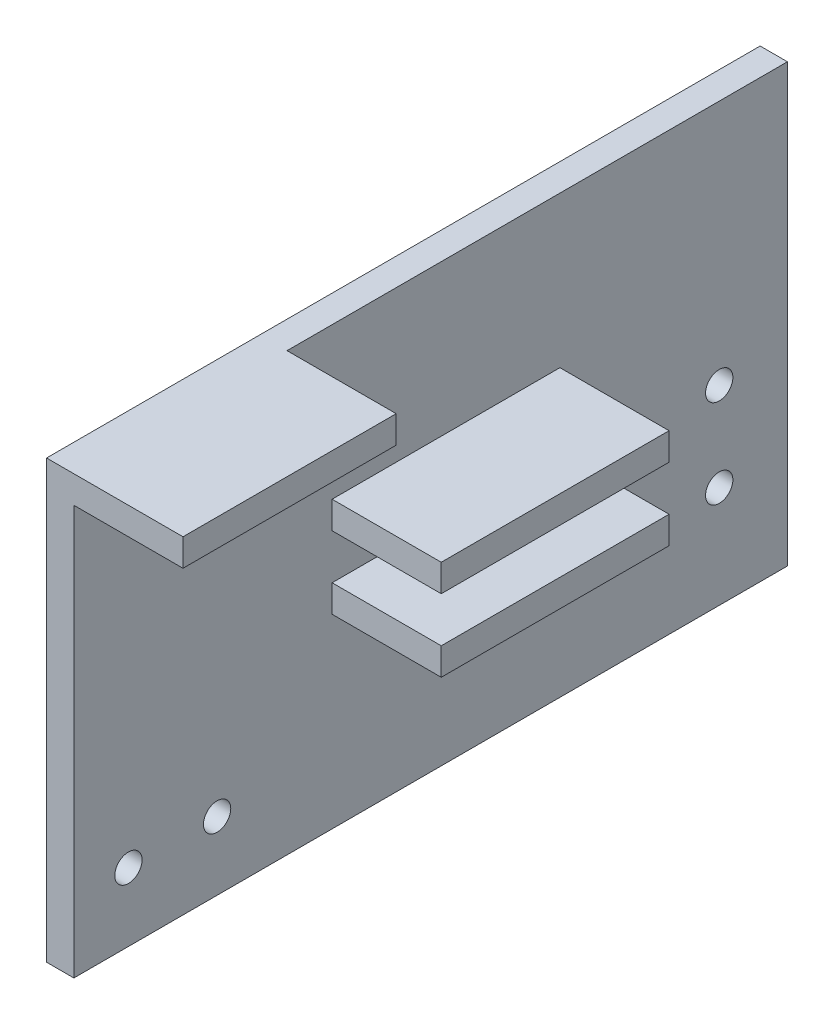
ISO-10303-21;
HEADER;
FILE_DESCRIPTION(('STEP AP214'),'2;1');
FILE_NAME('part.step','',(''),(''),'','','');
FILE_SCHEMA(('AUTOMOTIVE_DESIGN { 1 0 10303 214 1 1 1 1 }'));
ENDSEC;
DATA;
#1=APPLICATION_CONTEXT('core data for automotive mechanical design processes');
#2=APPLICATION_PROTOCOL_DEFINITION('international standard','automotive_design',2000,#1);
#3=PRODUCT_CONTEXT('',#1,'mechanical');
#4=PRODUCT('Part','Part','',(#3));
#5=PRODUCT_RELATED_PRODUCT_CATEGORY('part','',(#4));
#6=PRODUCT_DEFINITION_FORMATION('','',#4);
#7=PRODUCT_DEFINITION_CONTEXT('part definition',#1,'design');
#8=PRODUCT_DEFINITION('design','',#6,#7);
#9=PRODUCT_DEFINITION_SHAPE('','',#8);
#10=(LENGTH_UNIT() NAMED_UNIT(*) SI_UNIT(.MILLI.,.METRE.));
#11=(NAMED_UNIT(*) PLANE_ANGLE_UNIT() SI_UNIT($,.RADIAN.));
#12=(NAMED_UNIT(*) SI_UNIT($,.STERADIAN.) SOLID_ANGLE_UNIT());
#13=UNCERTAINTY_MEASURE_WITH_UNIT(LENGTH_MEASURE(1.E-05),#10,'distance_accuracy_value','');
#14=(GEOMETRIC_REPRESENTATION_CONTEXT(3) GLOBAL_UNCERTAINTY_ASSIGNED_CONTEXT((#13)) GLOBAL_UNIT_ASSIGNED_CONTEXT((#10,
#11,#12)) REPRESENTATION_CONTEXT('',''));
#15=CARTESIAN_POINT('',(0.,0.,0.));
#16=DIRECTION('',(0.,0.,1.));
#17=DIRECTION('',(1.,0.,0.));
#18=AXIS2_PLACEMENT_3D('',#15,#16,#17);
#19=CARTESIAN_POINT('',(2.,14.73202564,0.));
#20=DIRECTION('',(0.,-1.,0.));
#21=DIRECTION('',(0.,0.,-1.));
#22=AXIS2_PLACEMENT_3D('',#19,#20,#21);
#23=PLANE('',#22);
#24=DIRECTION('',(0.,0.,1.));
#25=VECTOR('',#24,1.);
#26=CARTESIAN_POINT('',(0.,14.73202564,0.));
#27=LINE('',#26,#25);
#28=CARTESIAN_POINT('',(0.,14.73202564,-52.3));
#29=VERTEX_POINT('',#28);
#30=CARTESIAN_POINT('',(0.,14.73202564,0.));
#31=VERTEX_POINT('',#30);
#32=EDGE_CURVE('E273',#29,#31,#27,.T.);
#33=ORIENTED_EDGE('',*,*,#32,.T.);
#34=DIRECTION('',(-1.,0.,0.));
#35=VECTOR('',#34,1.);
#36=CARTESIAN_POINT('',(2.,14.73202564,0.));
#37=LINE('',#36,#35);
#38=CARTESIAN_POINT('',(10.,14.73202564,0.));
#39=VERTEX_POINT('',#38);
#40=EDGE_CURVE('E11',#39,#31,#37,.T.);
#41=ORIENTED_EDGE('',*,*,#40,.F.);
#42=DIRECTION('',(0.,0.,1.));
#43=VECTOR('',#42,1.);
#44=CARTESIAN_POINT('',(10.,14.73202564,0.));
#45=LINE('',#44,#43);
#46=CARTESIAN_POINT('',(10.,14.73202564,-15.625));
#47=VERTEX_POINT('',#46);
#48=EDGE_CURVE('E218',#47,#39,#45,.T.);
#49=ORIENTED_EDGE('',*,*,#48,.F.);
#50=DIRECTION('',(-1.,0.,0.));
#51=VECTOR('',#50,1.);
#52=CARTESIAN_POINT('',(10.,14.73202564,-15.625));
#53=LINE('',#52,#51);
#54=CARTESIAN_POINT('',(2.,14.73202564,-15.625));
#55=VERTEX_POINT('',#54);
#56=EDGE_CURVE('E230',#47,#55,#53,.T.);
#57=ORIENTED_EDGE('',*,*,#56,.T.);
#58=DIRECTION('',(0.,0.,1.));
#59=VECTOR('',#58,1.);
#60=CARTESIAN_POINT('',(2.,14.73202564,0.));
#61=LINE('',#60,#59);
#62=CARTESIAN_POINT('',(2.,14.73202564,-52.3));
#63=VERTEX_POINT('',#62);
#64=EDGE_CURVE('E252',#63,#55,#61,.T.);
#65=ORIENTED_EDGE('',*,*,#64,.F.);
#66=DIRECTION('',(-1.,0.,0.));
#67=VECTOR('',#66,1.);
#68=CARTESIAN_POINT('',(2.,14.73202564,-52.3));
#69=LINE('',#68,#67);
#70=EDGE_CURVE('E261',#63,#29,#69,.T.);
#71=ORIENTED_EDGE('',*,*,#70,.T.);
#72=EDGE_LOOP('',(#33,#41,#49,#57,#65,#71));
#73=FACE_BOUND('',#72,.T.);
#74=ADVANCED_FACE('F36',(#73),#23,.F.);
#75=CARTESIAN_POINT('',(2.,0.,0.));
#76=DIRECTION('',(0.,0.,-1.));
#77=DIRECTION('',(0.,1.,0.));
#78=AXIS2_PLACEMENT_3D('',#75,#76,#77);
#79=PLANE('',#78);
#80=DIRECTION('',(0.,-1.,0.));
#81=VECTOR('',#80,1.);
#82=CARTESIAN_POINT('',(0.,0.,0.));
#83=LINE('',#82,#81);
#84=CARTESIAN_POINT('',(0.,-17.27497436,0.));
#85=VERTEX_POINT('',#84);
#86=EDGE_CURVE('E275',#31,#85,#83,.T.);
#87=ORIENTED_EDGE('',*,*,#86,.T.);
#88=DIRECTION('',(-1.,0.,0.));
#89=VECTOR('',#88,1.);
#90=CARTESIAN_POINT('',(2.,-17.27497436,0.));
#91=LINE('',#90,#89);
#92=CARTESIAN_POINT('',(2.,-17.27497436,0.));
#93=VERTEX_POINT('',#92);
#94=EDGE_CURVE('E44',#93,#85,#91,.T.);
#95=ORIENTED_EDGE('',*,*,#94,.F.);
#96=DIRECTION('',(0.,-1.,0.));
#97=VECTOR('',#96,1.);
#98=CARTESIAN_POINT('',(2.,0.,0.));
#99=LINE('',#98,#97);
#100=CARTESIAN_POINT('',(2.,12.73202564,0.));
#101=VERTEX_POINT('',#100);
#102=EDGE_CURVE('E255',#101,#93,#99,.T.);
#103=ORIENTED_EDGE('',*,*,#102,.F.);
#104=DIRECTION('',(-1.,0.,0.));
#105=VECTOR('',#104,1.);
#106=CARTESIAN_POINT('',(10.,12.73202564,0.));
#107=LINE('',#106,#105);
#108=CARTESIAN_POINT('',(10.,12.73202564,0.));
#109=VERTEX_POINT('',#108);
#110=EDGE_CURVE('E228',#109,#101,#107,.T.);
#111=ORIENTED_EDGE('',*,*,#110,.F.);
#112=DIRECTION('',(0.,-1.,0.));
#113=VECTOR('',#112,1.);
#114=CARTESIAN_POINT('',(10.,0.,0.));
#115=LINE('',#114,#113);
#116=EDGE_CURVE('E221',#39,#109,#115,.T.);
#117=ORIENTED_EDGE('',*,*,#116,.F.);
#118=ORIENTED_EDGE('',*,*,#40,.T.);
#119=EDGE_LOOP('',(#87,#95,#103,#111,#117,#118));
#120=FACE_BOUND('',#119,.T.);
#121=ADVANCED_FACE('F311',(#120),#79,.F.);
#122=CARTESIAN_POINT('',(2.,-17.27497436,0.));
#123=DIRECTION('',(0.,1.,0.));
#124=DIRECTION('',(0.,0.,1.));
#125=AXIS2_PLACEMENT_3D('',#122,#123,#124);
#126=PLANE('',#125);
#127=DIRECTION('',(0.,0.,-1.));
#128=VECTOR('',#127,1.);
#129=CARTESIAN_POINT('',(0.,-17.27497436,0.));
#130=LINE('',#129,#128);
#131=CARTESIAN_POINT('',(0.,-17.27497436,-52.3));
#132=VERTEX_POINT('',#131);
#133=EDGE_CURVE('E277',#85,#132,#130,.T.);
#134=ORIENTED_EDGE('',*,*,#133,.T.);
#135=DIRECTION('',(-1.,0.,0.));
#136=VECTOR('',#135,1.);
#137=CARTESIAN_POINT('',(2.,-17.27497436,-52.3));
#138=LINE('',#137,#136);
#139=CARTESIAN_POINT('',(2.,-17.27497436,-52.3));
#140=VERTEX_POINT('',#139);
#141=EDGE_CURVE('E282',#140,#132,#138,.T.);
#142=ORIENTED_EDGE('',*,*,#141,.F.);
#143=DIRECTION('',(0.,0.,-1.));
#144=VECTOR('',#143,1.);
#145=CARTESIAN_POINT('',(2.,-17.27497436,0.));
#146=LINE('',#145,#144);
#147=EDGE_CURVE('E257',#93,#140,#146,.T.);
#148=ORIENTED_EDGE('',*,*,#147,.F.);
#149=ORIENTED_EDGE('',*,*,#94,.T.);
#150=EDGE_LOOP('',(#134,#142,#148,#149));
#151=FACE_BOUND('',#150,.T.);
#152=ADVANCED_FACE('F289',(#151),#126,.F.);
#153=CARTESIAN_POINT('',(2.,-12.27497436,-4.00000000000001));
#154=DIRECTION('',(-1.,0.,0.));
#155=DIRECTION('',(0.,0.,1.));
#156=AXIS2_PLACEMENT_3D('',#153,#154,#155);
#157=CYLINDRICAL_SURFACE('',#156,1.);
#158=CARTESIAN_POINT('',(2.,-12.27497436,-4.00000000000001));
#159=DIRECTION('',(1.,0.,0.));
#160=DIRECTION('',(0.,0.,-1.));
#161=AXIS2_PLACEMENT_3D('',#158,#159,#160);
#162=CIRCLE('',#161,1.);
#163=CARTESIAN_POINT('',(2.,-12.27497436,-5.00000000000001));
#164=VERTEX_POINT('',#163);
#165=EDGE_CURVE('E249',#164,#164,#162,.T.);
#166=ORIENTED_EDGE('',*,*,#165,.T.);
#167=EDGE_LOOP('',(#166));
#168=FACE_BOUND('',#167,.T.);
#169=CARTESIAN_POINT('',(0.,-12.27497436,-4.00000000000001));
#170=DIRECTION('',(1.,0.,0.));
#171=DIRECTION('',(0.,0.,-1.));
#172=AXIS2_PLACEMENT_3D('',#169,#170,#171);
#173=CIRCLE('',#172,1.);
#174=CARTESIAN_POINT('',(0.,-12.27497436,-5.00000000000001));
#175=VERTEX_POINT('',#174);
#176=EDGE_CURVE('E270',#175,#175,#173,.T.);
#177=ORIENTED_EDGE('',*,*,#176,.F.);
#178=EDGE_LOOP('',(#177));
#179=FACE_BOUND('',#178,.T.);
#180=ADVANCED_FACE('F339',(#168,#179),#157,.F.);
#181=CARTESIAN_POINT('',(2.,-12.27497436,-10.5));
#182=DIRECTION('',(-1.,0.,0.));
#183=DIRECTION('',(0.,0.,1.));
#184=AXIS2_PLACEMENT_3D('',#181,#182,#183);
#185=CYLINDRICAL_SURFACE('',#184,1.);
#186=CARTESIAN_POINT('',(2.,-12.27497436,-10.5));
#187=DIRECTION('',(1.,0.,0.));
#188=DIRECTION('',(0.,0.,-1.));
#189=AXIS2_PLACEMENT_3D('',#186,#187,#188);
#190=CIRCLE('',#189,1.);
#191=CARTESIAN_POINT('',(2.,-12.27497436,-11.5));
#192=VERTEX_POINT('',#191);
#193=EDGE_CURVE('E246',#192,#192,#190,.T.);
#194=ORIENTED_EDGE('',*,*,#193,.T.);
#195=EDGE_LOOP('',(#194));
#196=FACE_BOUND('',#195,.T.);
#197=CARTESIAN_POINT('',(0.,-12.27497436,-10.5));
#198=DIRECTION('',(1.,0.,0.));
#199=DIRECTION('',(0.,0.,-1.));
#200=AXIS2_PLACEMENT_3D('',#197,#198,#199);
#201=CIRCLE('',#200,1.);
#202=CARTESIAN_POINT('',(0.,-12.27497436,-11.5));
#203=VERTEX_POINT('',#202);
#204=EDGE_CURVE('E267',#203,#203,#201,.T.);
#205=ORIENTED_EDGE('',*,*,#204,.F.);
#206=EDGE_LOOP('',(#205));
#207=FACE_BOUND('',#206,.T.);
#208=ADVANCED_FACE('F342',(#196,#207),#185,.F.);
#209=CARTESIAN_POINT('',(2.,-9.79999999999999,-47.3));
#210=DIRECTION('',(-1.,0.,0.));
#211=DIRECTION('',(0.,0.,1.));
#212=AXIS2_PLACEMENT_3D('',#209,#210,#211);
#213=CYLINDRICAL_SURFACE('',#212,0.999999999999998);
#214=CARTESIAN_POINT('',(2.,-9.79999999999999,-47.3));
#215=DIRECTION('',(1.,0.,0.));
#216=DIRECTION('',(0.,0.,-1.));
#217=AXIS2_PLACEMENT_3D('',#214,#215,#216);
#218=CIRCLE('',#217,0.999999999999998);
#219=CARTESIAN_POINT('',(2.,-9.79999999999999,-48.3));
#220=VERTEX_POINT('',#219);
#221=EDGE_CURVE('E242',#220,#220,#218,.T.);
#222=ORIENTED_EDGE('',*,*,#221,.T.);
#223=EDGE_LOOP('',(#222));
#224=FACE_BOUND('',#223,.T.);
#225=CARTESIAN_POINT('',(0.,-9.79999999999999,-47.3));
#226=DIRECTION('',(1.,0.,0.));
#227=DIRECTION('',(0.,0.,-1.));
#228=AXIS2_PLACEMENT_3D('',#225,#226,#227);
#229=CIRCLE('',#228,0.999999999999998);
#230=CARTESIAN_POINT('',(0.,-9.79999999999999,-48.3));
#231=VERTEX_POINT('',#230);
#232=EDGE_CURVE('E264',#231,#231,#229,.T.);
#233=ORIENTED_EDGE('',*,*,#232,.F.);
#234=EDGE_LOOP('',(#233));
#235=FACE_BOUND('',#234,.T.);
#236=ADVANCED_FACE('F345',(#224,#235),#213,.F.);
#237=CARTESIAN_POINT('',(2.,-3.3,-47.3));
#238=DIRECTION('',(-1.,0.,0.));
#239=DIRECTION('',(0.,0.,1.));
#240=AXIS2_PLACEMENT_3D('',#237,#238,#239);
#241=CYLINDRICAL_SURFACE('',#240,0.999999999999998);
#242=CARTESIAN_POINT('',(2.,-3.3,-47.3));
#243=DIRECTION('',(1.,0.,0.));
#244=DIRECTION('',(0.,0.,-1.));
#245=AXIS2_PLACEMENT_3D('',#242,#243,#244);
#246=CIRCLE('',#245,0.999999999999998);
#247=CARTESIAN_POINT('',(2.,-3.3,-48.3));
#248=VERTEX_POINT('',#247);
#249=EDGE_CURVE('E239',#248,#248,#246,.T.);
#250=ORIENTED_EDGE('',*,*,#249,.T.);
#251=EDGE_LOOP('',(#250));
#252=FACE_BOUND('',#251,.T.);
#253=CARTESIAN_POINT('',(0.,-3.3,-47.3));
#254=DIRECTION('',(1.,0.,0.));
#255=DIRECTION('',(0.,0.,-1.));
#256=AXIS2_PLACEMENT_3D('',#253,#254,#255);
#257=CIRCLE('',#256,0.999999999999998);
#258=CARTESIAN_POINT('',(0.,-3.3,-48.3));
#259=VERTEX_POINT('',#258);
#260=EDGE_CURVE('E238',#259,#259,#257,.T.);
#261=ORIENTED_EDGE('',*,*,#260,.F.);
#262=EDGE_LOOP('',(#261));
#263=FACE_BOUND('',#262,.T.);
#264=ADVANCED_FACE('F38',(#252,#263),#241,.F.);
#265=CARTESIAN_POINT('',(2.,0.,-52.3));
#266=DIRECTION('',(0.,0.,1.));
#267=DIRECTION('',(1.,0.,0.));
#268=AXIS2_PLACEMENT_3D('',#265,#266,#267);
#269=PLANE('',#268);
#270=DIRECTION('',(0.,1.,0.));
#271=VECTOR('',#270,1.);
#272=CARTESIAN_POINT('',(0.,0.,-52.3));
#273=LINE('',#272,#271);
#274=EDGE_CURVE('E243',#132,#29,#273,.T.);
#275=ORIENTED_EDGE('',*,*,#274,.T.);
#276=ORIENTED_EDGE('',*,*,#70,.F.);
#277=DIRECTION('',(0.,1.,0.));
#278=VECTOR('',#277,1.);
#279=CARTESIAN_POINT('',(2.,0.,-52.3));
#280=LINE('',#279,#278);
#281=EDGE_CURVE('E259',#140,#63,#280,.T.);
#282=ORIENTED_EDGE('',*,*,#281,.F.);
#283=ORIENTED_EDGE('',*,*,#141,.T.);
#284=EDGE_LOOP('',(#275,#276,#282,#283));
#285=FACE_BOUND('',#284,.T.);
#286=ADVANCED_FACE('F301',(#285),#269,.F.);
#287=CARTESIAN_POINT('',(2.,0.,0.));
#288=DIRECTION('',(1.,0.,0.));
#289=DIRECTION('',(0.,0.,-1.));
#290=AXIS2_PLACEMENT_3D('',#287,#288,#289);
#291=PLANE('',#290);
#292=DIRECTION('',(0.,1.,0.));
#293=VECTOR('',#292,1.);
#294=CARTESIAN_POINT('',(2.,0.,-35.625));
#295=LINE('',#294,#293);
#296=CARTESIAN_POINT('',(2.,-3.651,-35.625));
#297=VERTEX_POINT('',#296);
#298=CARTESIAN_POINT('',(2.,-1.651,-35.625));
#299=VERTEX_POINT('',#298);
#300=EDGE_CURVE('E151',#297,#299,#295,.T.);
#301=ORIENTED_EDGE('',*,*,#300,.F.);
#302=DIRECTION('',(0.,0.,1.));
#303=VECTOR('',#302,1.);
#304=CARTESIAN_POINT('',(2.,-3.651,0.));
#305=LINE('',#304,#303);
#306=CARTESIAN_POINT('',(2.,-3.651,-18.927));
#307=VERTEX_POINT('',#306);
#308=EDGE_CURVE('E155',#297,#307,#305,.T.);
#309=ORIENTED_EDGE('',*,*,#308,.T.);
#310=DIRECTION('',(0.,1.,0.));
#311=VECTOR('',#310,1.);
#312=CARTESIAN_POINT('',(2.,0.,-18.927));
#313=LINE('',#312,#311);
#314=CARTESIAN_POINT('',(2.,-1.651,-18.927));
#315=VERTEX_POINT('',#314);
#316=EDGE_CURVE('E179',#307,#315,#313,.T.);
#317=ORIENTED_EDGE('',*,*,#316,.T.);
#318=DIRECTION('',(0.,0.,1.));
#319=VECTOR('',#318,1.);
#320=CARTESIAN_POINT('',(2.,-1.651,0.));
#321=LINE('',#320,#319);
#322=EDGE_CURVE('E182',#299,#315,#321,.T.);
#323=ORIENTED_EDGE('',*,*,#322,.F.);
#324=EDGE_LOOP('',(#301,#309,#317,#323));
#325=FACE_BOUND('',#324,.T.);
#326=DIRECTION('',(0.,1.,0.));
#327=VECTOR('',#326,1.);
#328=CARTESIAN_POINT('',(2.,0.,-35.625));
#329=LINE('',#328,#327);
#330=CARTESIAN_POINT('',(2.,1.651,-35.625));
#331=VERTEX_POINT('',#330);
#332=CARTESIAN_POINT('',(2.,3.651,-35.625));
#333=VERTEX_POINT('',#332);
#334=EDGE_CURVE('E213',#331,#333,#329,.T.);
#335=ORIENTED_EDGE('',*,*,#334,.F.);
#336=DIRECTION('',(0.,0.,1.));
#337=VECTOR('',#336,1.);
#338=CARTESIAN_POINT('',(2.,1.651,0.));
#339=LINE('',#338,#337);
#340=CARTESIAN_POINT('',(2.,1.651,-18.927));
#341=VERTEX_POINT('',#340);
#342=EDGE_CURVE('E205',#331,#341,#339,.T.);
#343=ORIENTED_EDGE('',*,*,#342,.T.);
#344=DIRECTION('',(0.,1.,0.));
#345=VECTOR('',#344,1.);
#346=CARTESIAN_POINT('',(2.,0.,-18.927));
#347=LINE('',#346,#345);
#348=CARTESIAN_POINT('',(2.,3.651,-18.927));
#349=VERTEX_POINT('',#348);
#350=EDGE_CURVE('E208',#341,#349,#347,.T.);
#351=ORIENTED_EDGE('',*,*,#350,.T.);
#352=DIRECTION('',(0.,0.,1.));
#353=VECTOR('',#352,1.);
#354=CARTESIAN_POINT('',(2.,3.651,0.));
#355=LINE('',#354,#353);
#356=EDGE_CURVE('E211',#333,#349,#355,.T.);
#357=ORIENTED_EDGE('',*,*,#356,.F.);
#358=EDGE_LOOP('',(#335,#343,#351,#357));
#359=FACE_BOUND('',#358,.T.);
#360=DIRECTION('',(0.,1.,0.));
#361=VECTOR('',#360,1.);
#362=CARTESIAN_POINT('',(2.,0.,-15.625));
#363=LINE('',#362,#361);
#364=CARTESIAN_POINT('',(2.,12.73202564,-15.625));
#365=VERTEX_POINT('',#364);
#366=EDGE_CURVE('E236',#365,#55,#363,.T.);
#367=ORIENTED_EDGE('',*,*,#366,.F.);
#368=DIRECTION('',(0.,0.,1.));
#369=VECTOR('',#368,1.);
#370=CARTESIAN_POINT('',(2.,12.73202564,0.));
#371=LINE('',#370,#369);
#372=EDGE_CURVE('E233',#365,#101,#371,.T.);
#373=ORIENTED_EDGE('',*,*,#372,.T.);
#374=ORIENTED_EDGE('',*,*,#102,.T.);
#375=ORIENTED_EDGE('',*,*,#147,.T.);
#376=ORIENTED_EDGE('',*,*,#281,.T.);
#377=ORIENTED_EDGE('',*,*,#64,.T.);
#378=EDGE_LOOP('',(#367,#373,#374,#375,#376,#377));
#379=FACE_BOUND('',#378,.T.);
#380=ORIENTED_EDGE('',*,*,#249,.F.);
#381=EDGE_LOOP('',(#380));
#382=FACE_BOUND('',#381,.T.);
#383=ORIENTED_EDGE('',*,*,#221,.F.);
#384=EDGE_LOOP('',(#383));
#385=FACE_BOUND('',#384,.T.);
#386=ORIENTED_EDGE('',*,*,#193,.F.);
#387=EDGE_LOOP('',(#386));
#388=FACE_BOUND('',#387,.T.);
#389=ORIENTED_EDGE('',*,*,#165,.F.);
#390=EDGE_LOOP('',(#389));
#391=FACE_BOUND('',#390,.T.);
#392=ADVANCED_FACE('F308',(#325,#359,#379,#382,#385,#388,#391),#291,.T.);
#393=CARTESIAN_POINT('',(0.,0.,0.));
#394=DIRECTION('',(1.,0.,0.));
#395=DIRECTION('',(0.,0.,-1.));
#396=AXIS2_PLACEMENT_3D('',#393,#394,#395);
#397=PLANE('',#396);
#398=ORIENTED_EDGE('',*,*,#86,.F.);
#399=ORIENTED_EDGE('',*,*,#32,.F.);
#400=ORIENTED_EDGE('',*,*,#274,.F.);
#401=ORIENTED_EDGE('',*,*,#133,.F.);
#402=EDGE_LOOP('',(#398,#399,#400,#401));
#403=FACE_BOUND('',#402,.T.);
#404=ORIENTED_EDGE('',*,*,#260,.T.);
#405=EDGE_LOOP('',(#404));
#406=FACE_BOUND('',#405,.T.);
#407=ORIENTED_EDGE('',*,*,#232,.T.);
#408=EDGE_LOOP('',(#407));
#409=FACE_BOUND('',#408,.T.);
#410=ORIENTED_EDGE('',*,*,#204,.T.);
#411=EDGE_LOOP('',(#410));
#412=FACE_BOUND('',#411,.T.);
#413=ORIENTED_EDGE('',*,*,#176,.T.);
#414=EDGE_LOOP('',(#413));
#415=FACE_BOUND('',#414,.T.);
#416=ADVANCED_FACE('F296',(#403,#406,#409,#412,#415),#397,.F.);
#417=CARTESIAN_POINT('',(10.,0.,-15.625));
#418=DIRECTION('',(0.,0.,-1.));
#419=DIRECTION('',(0.,1.,0.));
#420=AXIS2_PLACEMENT_3D('',#417,#418,#419);
#421=PLANE('',#420);
#422=DIRECTION('',(-1.,0.,0.));
#423=VECTOR('',#422,1.);
#424=CARTESIAN_POINT('',(10.,12.73202564,-15.625));
#425=LINE('',#424,#423);
#426=CARTESIAN_POINT('',(10.,12.73202564,-15.625));
#427=VERTEX_POINT('',#426);
#428=EDGE_CURVE('E225',#427,#365,#425,.T.);
#429=ORIENTED_EDGE('',*,*,#428,.T.);
#430=ORIENTED_EDGE('',*,*,#366,.T.);
#431=ORIENTED_EDGE('',*,*,#56,.F.);
#432=DIRECTION('',(0.,-1.,0.));
#433=VECTOR('',#432,1.);
#434=CARTESIAN_POINT('',(10.,0.,-15.625));
#435=LINE('',#434,#433);
#436=EDGE_CURVE('E215',#47,#427,#435,.T.);
#437=ORIENTED_EDGE('',*,*,#436,.T.);
#438=EDGE_LOOP('',(#429,#430,#431,#437));
#439=FACE_BOUND('',#438,.T.);
#440=ADVANCED_FACE('F321',(#439),#421,.T.);
#441=CARTESIAN_POINT('',(10.,12.73202564,0.));
#442=DIRECTION('',(0.,1.,0.));
#443=DIRECTION('',(0.,0.,1.));
#444=AXIS2_PLACEMENT_3D('',#441,#442,#443);
#445=PLANE('',#444);
#446=ORIENTED_EDGE('',*,*,#372,.F.);
#447=ORIENTED_EDGE('',*,*,#428,.F.);
#448=DIRECTION('',(0.,0.,-1.));
#449=VECTOR('',#448,1.);
#450=CARTESIAN_POINT('',(10.,12.73202564,0.));
#451=LINE('',#450,#449);
#452=EDGE_CURVE('E223',#109,#427,#451,.T.);
#453=ORIENTED_EDGE('',*,*,#452,.F.);
#454=ORIENTED_EDGE('',*,*,#110,.T.);
#455=EDGE_LOOP('',(#446,#447,#453,#454));
#456=FACE_BOUND('',#455,.T.);
#457=ADVANCED_FACE('F316',(#456),#445,.F.);
#458=CARTESIAN_POINT('',(10.,0.,0.));
#459=DIRECTION('',(1.,0.,0.));
#460=DIRECTION('',(0.,0.,-1.));
#461=AXIS2_PLACEMENT_3D('',#458,#459,#460);
#462=PLANE('',#461);
#463=ORIENTED_EDGE('',*,*,#436,.F.);
#464=ORIENTED_EDGE('',*,*,#48,.T.);
#465=ORIENTED_EDGE('',*,*,#116,.T.);
#466=ORIENTED_EDGE('',*,*,#452,.T.);
#467=EDGE_LOOP('',(#463,#464,#465,#466));
#468=FACE_BOUND('',#467,.T.);
#469=ADVANCED_FACE('F319',(#468),#462,.T.);
#470=CARTESIAN_POINT('',(10.,0.,-35.625));
#471=DIRECTION('',(0.,0.,-1.));
#472=DIRECTION('',(-1.,0.,0.));
#473=AXIS2_PLACEMENT_3D('',#470,#471,#472);
#474=PLANE('',#473);
#475=DIRECTION('',(-1.,0.,0.));
#476=VECTOR('',#475,1.);
#477=CARTESIAN_POINT('',(10.,1.651,-35.625));
#478=LINE('',#477,#476);
#479=CARTESIAN_POINT('',(10.,1.651,-35.625));
#480=VERTEX_POINT('',#479);
#481=EDGE_CURVE('E195',#480,#331,#478,.T.);
#482=ORIENTED_EDGE('',*,*,#481,.T.);
#483=ORIENTED_EDGE('',*,*,#334,.T.);
#484=DIRECTION('',(-1.,0.,0.));
#485=VECTOR('',#484,1.);
#486=CARTESIAN_POINT('',(10.,3.651,-35.625));
#487=LINE('',#486,#485);
#488=CARTESIAN_POINT('',(10.,3.651,-35.625));
#489=VERTEX_POINT('',#488);
#490=EDGE_CURVE('E202',#489,#333,#487,.T.);
#491=ORIENTED_EDGE('',*,*,#490,.F.);
#492=DIRECTION('',(0.,-1.,0.));
#493=VECTOR('',#492,1.);
#494=CARTESIAN_POINT('',(10.,0.,-35.625));
#495=LINE('',#494,#493);
#496=EDGE_CURVE('E185',#489,#480,#495,.T.);
#497=ORIENTED_EDGE('',*,*,#496,.T.);
#498=EDGE_LOOP('',(#482,#483,#491,#497));
#499=FACE_BOUND('',#498,.T.);
#500=ADVANCED_FACE('F445',(#499),#474,.T.);
#501=CARTESIAN_POINT('',(10.,3.651,0.));
#502=DIRECTION('',(0.,1.,0.));
#503=DIRECTION('',(0.,0.,1.));
#504=AXIS2_PLACEMENT_3D('',#501,#502,#503);
#505=PLANE('',#504);
#506=ORIENTED_EDGE('',*,*,#490,.T.);
#507=ORIENTED_EDGE('',*,*,#356,.T.);
#508=DIRECTION('',(-1.,0.,0.));
#509=VECTOR('',#508,1.);
#510=CARTESIAN_POINT('',(10.,3.651,-18.927));
#511=LINE('',#510,#509);
#512=CARTESIAN_POINT('',(10.,3.651,-18.927));
#513=VERTEX_POINT('',#512);
#514=EDGE_CURVE('E199',#513,#349,#511,.T.);
#515=ORIENTED_EDGE('',*,*,#514,.F.);
#516=DIRECTION('',(0.,0.,-1.));
#517=VECTOR('',#516,1.);
#518=CARTESIAN_POINT('',(10.,3.651,0.));
#519=LINE('',#518,#517);
#520=EDGE_CURVE('E188',#513,#489,#519,.T.);
#521=ORIENTED_EDGE('',*,*,#520,.T.);
#522=EDGE_LOOP('',(#506,#507,#515,#521));
#523=FACE_BOUND('',#522,.T.);
#524=ADVANCED_FACE('F454',(#523),#505,.T.);
#525=CARTESIAN_POINT('',(10.,0.,-18.927));
#526=DIRECTION('',(0.,0.,-1.));
#527=DIRECTION('',(-1.,0.,0.));
#528=AXIS2_PLACEMENT_3D('',#525,#526,#527);
#529=PLANE('',#528);
#530=ORIENTED_EDGE('',*,*,#350,.F.);
#531=DIRECTION('',(-1.,0.,0.));
#532=VECTOR('',#531,1.);
#533=CARTESIAN_POINT('',(10.,1.651,-18.927));
#534=LINE('',#533,#532);
#535=CARTESIAN_POINT('',(10.,1.651,-18.927));
#536=VERTEX_POINT('',#535);
#537=EDGE_CURVE('E59',#536,#341,#534,.T.);
#538=ORIENTED_EDGE('',*,*,#537,.F.);
#539=DIRECTION('',(0.,-1.,0.));
#540=VECTOR('',#539,1.);
#541=CARTESIAN_POINT('',(10.,0.,-18.927));
#542=LINE('',#541,#540);
#543=EDGE_CURVE('E191',#513,#536,#542,.T.);
#544=ORIENTED_EDGE('',*,*,#543,.F.);
#545=ORIENTED_EDGE('',*,*,#514,.T.);
#546=EDGE_LOOP('',(#530,#538,#544,#545));
#547=FACE_BOUND('',#546,.T.);
#548=ADVANCED_FACE('F464',(#547),#529,.F.);
#549=CARTESIAN_POINT('',(10.,1.651,0.));
#550=DIRECTION('',(0.,1.,0.));
#551=DIRECTION('',(0.,0.,1.));
#552=AXIS2_PLACEMENT_3D('',#549,#550,#551);
#553=PLANE('',#552);
#554=ORIENTED_EDGE('',*,*,#342,.F.);
#555=ORIENTED_EDGE('',*,*,#481,.F.);
#556=DIRECTION('',(0.,0.,-1.));
#557=VECTOR('',#556,1.);
#558=CARTESIAN_POINT('',(10.,1.651,0.));
#559=LINE('',#558,#557);
#560=EDGE_CURVE('E193',#536,#480,#559,.T.);
#561=ORIENTED_EDGE('',*,*,#560,.F.);
#562=ORIENTED_EDGE('',*,*,#537,.T.);
#563=EDGE_LOOP('',(#554,#555,#561,#562));
#564=FACE_BOUND('',#563,.T.);
#565=ADVANCED_FACE('F474',(#564),#553,.F.);
#566=CARTESIAN_POINT('',(10.,0.,0.));
#567=DIRECTION('',(1.,0.,0.));
#568=DIRECTION('',(0.,0.,-1.));
#569=AXIS2_PLACEMENT_3D('',#566,#567,#568);
#570=PLANE('',#569);
#571=ORIENTED_EDGE('',*,*,#496,.F.);
#572=ORIENTED_EDGE('',*,*,#520,.F.);
#573=ORIENTED_EDGE('',*,*,#543,.T.);
#574=ORIENTED_EDGE('',*,*,#560,.T.);
#575=EDGE_LOOP('',(#571,#572,#573,#574));
#576=FACE_BOUND('',#575,.T.);
#577=ADVANCED_FACE('F484',(#576),#570,.T.);
#578=CARTESIAN_POINT('',(10.,0.,-35.625));
#579=DIRECTION('',(0.,0.,-1.));
#580=DIRECTION('',(-1.,0.,0.));
#581=AXIS2_PLACEMENT_3D('',#578,#579,#580);
#582=PLANE('',#581);
#583=DIRECTION('',(-1.,0.,0.));
#584=VECTOR('',#583,1.);
#585=CARTESIAN_POINT('',(10.,-3.651,-35.625));
#586=LINE('',#585,#584);
#587=CARTESIAN_POINT('',(10.,-3.651,-35.625));
#588=VERTEX_POINT('',#587);
#589=EDGE_CURVE('E173',#588,#297,#586,.T.);
#590=ORIENTED_EDGE('',*,*,#589,.T.);
#591=ORIENTED_EDGE('',*,*,#300,.T.);
#592=DIRECTION('',(-1.,0.,0.));
#593=VECTOR('',#592,1.);
#594=CARTESIAN_POINT('',(10.,-1.651,-35.625));
#595=LINE('',#594,#593);
#596=CARTESIAN_POINT('',(10.,-1.651,-35.625));
#597=VERTEX_POINT('',#596);
#598=EDGE_CURVE('E145',#597,#299,#595,.T.);
#599=ORIENTED_EDGE('',*,*,#598,.F.);
#600=DIRECTION('',(0.,-1.,0.));
#601=VECTOR('',#600,1.);
#602=CARTESIAN_POINT('',(10.,0.,-35.625));
#603=LINE('',#602,#601);
#604=EDGE_CURVE('E149',#597,#588,#603,.T.);
#605=ORIENTED_EDGE('',*,*,#604,.T.);
#606=EDGE_LOOP('',(#590,#591,#599,#605));
#607=FACE_BOUND('',#606,.T.);
#608=ADVANCED_FACE('F148',(#607),#582,.T.);
#609=CARTESIAN_POINT('',(10.,-1.651,0.));
#610=DIRECTION('',(0.,1.,0.));
#611=DIRECTION('',(0.,0.,1.));
#612=AXIS2_PLACEMENT_3D('',#609,#610,#611);
#613=PLANE('',#612);
#614=ORIENTED_EDGE('',*,*,#598,.T.);
#615=ORIENTED_EDGE('',*,*,#322,.T.);
#616=DIRECTION('',(-1.,0.,0.));
#617=VECTOR('',#616,1.);
#618=CARTESIAN_POINT('',(10.,-1.651,-18.927));
#619=LINE('',#618,#617);
#620=CARTESIAN_POINT('',(10.,-1.651,-18.927));
#621=VERTEX_POINT('',#620);
#622=EDGE_CURVE('E156',#621,#315,#619,.T.);
#623=ORIENTED_EDGE('',*,*,#622,.F.);
#624=DIRECTION('',(0.,0.,-1.));
#625=VECTOR('',#624,1.);
#626=CARTESIAN_POINT('',(10.,-1.651,0.));
#627=LINE('',#626,#625);
#628=EDGE_CURVE('E161',#621,#597,#627,.T.);
#629=ORIENTED_EDGE('',*,*,#628,.T.);
#630=EDGE_LOOP('',(#614,#615,#623,#629));
#631=FACE_BOUND('',#630,.T.);
#632=ADVANCED_FACE('F165',(#631),#613,.T.);
#633=CARTESIAN_POINT('',(10.,0.,-18.927));
#634=DIRECTION('',(0.,0.,-1.));
#635=DIRECTION('',(-1.,0.,0.));
#636=AXIS2_PLACEMENT_3D('',#633,#634,#635);
#637=PLANE('',#636);
#638=ORIENTED_EDGE('',*,*,#316,.F.);
#639=DIRECTION('',(-1.,0.,0.));
#640=VECTOR('',#639,1.);
#641=CARTESIAN_POINT('',(10.,-3.651,-18.927));
#642=LINE('',#641,#640);
#643=CARTESIAN_POINT('',(10.,-3.651,-18.927));
#644=VERTEX_POINT('',#643);
#645=EDGE_CURVE('E51',#644,#307,#642,.T.);
#646=ORIENTED_EDGE('',*,*,#645,.F.);
#647=DIRECTION('',(0.,-1.,0.));
#648=VECTOR('',#647,1.);
#649=CARTESIAN_POINT('',(10.,0.,-18.927));
#650=LINE('',#649,#648);
#651=EDGE_CURVE('E168',#621,#644,#650,.T.);
#652=ORIENTED_EDGE('',*,*,#651,.F.);
#653=ORIENTED_EDGE('',*,*,#622,.T.);
#654=EDGE_LOOP('',(#638,#646,#652,#653));
#655=FACE_BOUND('',#654,.T.);
#656=ADVANCED_FACE('F510',(#655),#637,.F.);
#657=CARTESIAN_POINT('',(10.,-3.651,0.));
#658=DIRECTION('',(0.,1.,0.));
#659=DIRECTION('',(0.,0.,1.));
#660=AXIS2_PLACEMENT_3D('',#657,#658,#659);
#661=PLANE('',#660);
#662=ORIENTED_EDGE('',*,*,#308,.F.);
#663=ORIENTED_EDGE('',*,*,#589,.F.);
#664=DIRECTION('',(0.,0.,-1.));
#665=VECTOR('',#664,1.);
#666=CARTESIAN_POINT('',(10.,-3.651,0.));
#667=LINE('',#666,#665);
#668=EDGE_CURVE('E162',#644,#588,#667,.T.);
#669=ORIENTED_EDGE('',*,*,#668,.F.);
#670=ORIENTED_EDGE('',*,*,#645,.T.);
#671=EDGE_LOOP('',(#662,#663,#669,#670));
#672=FACE_BOUND('',#671,.T.);
#673=ADVANCED_FACE('F519',(#672),#661,.F.);
#674=CARTESIAN_POINT('',(10.,0.,0.));
#675=DIRECTION('',(1.,0.,0.));
#676=DIRECTION('',(0.,0.,-1.));
#677=AXIS2_PLACEMENT_3D('',#674,#675,#676);
#678=PLANE('',#677);
#679=ORIENTED_EDGE('',*,*,#604,.F.);
#680=ORIENTED_EDGE('',*,*,#628,.F.);
#681=ORIENTED_EDGE('',*,*,#651,.T.);
#682=ORIENTED_EDGE('',*,*,#668,.T.);
#683=EDGE_LOOP('',(#679,#680,#681,#682));
#684=FACE_BOUND('',#683,.T.);
#685=ADVANCED_FACE('F160',(#684),#678,.T.);
#686=CLOSED_SHELL('',(#74,#121,#152,#180,#208,#236,#264,#286,#392,#416,#440,#457,#469,#500,#524,
#548,#565,#577,#608,#632,#656,#673,#685));
#687=MANIFOLD_SOLID_BREP('B2',#686);
#688=ADVANCED_BREP_SHAPE_REPRESENTATION('',(#18,#687),#14);
#689=SHAPE_DEFINITION_REPRESENTATION(#9,#688);
ENDSEC;
END-ISO-10303-21;
